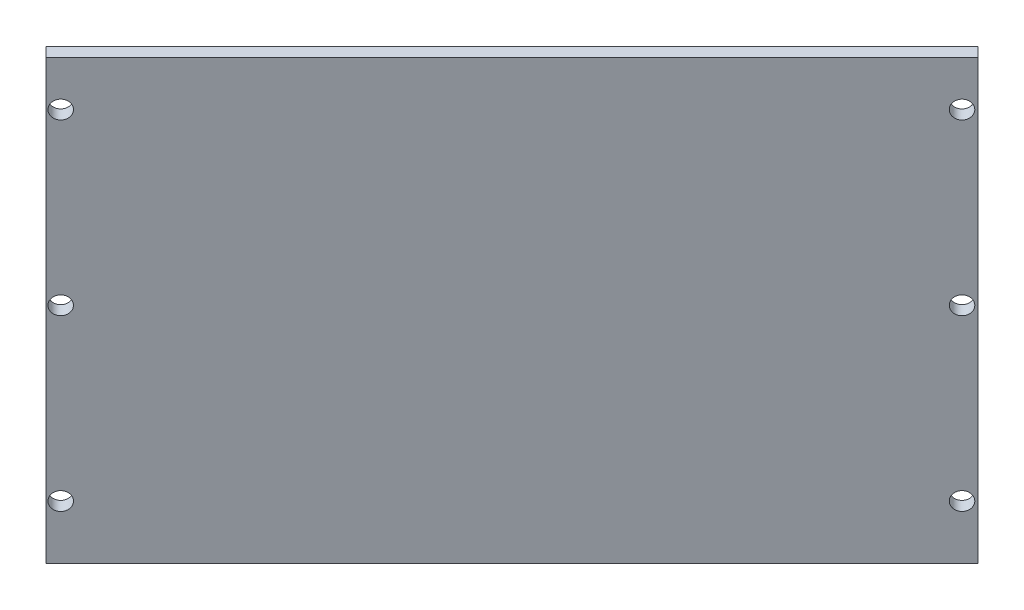
ISO-10303-21;
HEADER;
FILE_DESCRIPTION(('STEP AP214'),'2;1');
FILE_NAME('part.step','',(''),(''),'','','');
FILE_SCHEMA(('AUTOMOTIVE_DESIGN { 1 0 10303 214 1 1 1 1 }'));
ENDSEC;
DATA;
#1=APPLICATION_CONTEXT('core data for automotive mechanical design processes');
#2=APPLICATION_PROTOCOL_DEFINITION('international standard','automotive_design',2000,#1);
#3=PRODUCT_CONTEXT('',#1,'mechanical');
#4=PRODUCT('Part','Part','',(#3));
#5=PRODUCT_RELATED_PRODUCT_CATEGORY('part','',(#4));
#6=PRODUCT_DEFINITION_FORMATION('','',#4);
#7=PRODUCT_DEFINITION_CONTEXT('part definition',#1,'design');
#8=PRODUCT_DEFINITION('design','',#6,#7);
#9=PRODUCT_DEFINITION_SHAPE('','',#8);
#10=(LENGTH_UNIT() NAMED_UNIT(*) SI_UNIT(.MILLI.,.METRE.));
#11=(NAMED_UNIT(*) PLANE_ANGLE_UNIT() SI_UNIT($,.RADIAN.));
#12=(NAMED_UNIT(*) SI_UNIT($,.STERADIAN.) SOLID_ANGLE_UNIT());
#13=UNCERTAINTY_MEASURE_WITH_UNIT(LENGTH_MEASURE(1.E-05),#10,'distance_accuracy_value','');
#14=(GEOMETRIC_REPRESENTATION_CONTEXT(3) GLOBAL_UNCERTAINTY_ASSIGNED_CONTEXT((#13)) GLOBAL_UNIT_ASSIGNED_CONTEXT((#10,
#11,#12)) REPRESENTATION_CONTEXT('',''));
#15=CARTESIAN_POINT('',(0.,0.,0.));
#16=DIRECTION('',(0.,0.,1.));
#17=DIRECTION('',(1.,0.,0.));
#18=AXIS2_PLACEMENT_3D('',#15,#16,#17);
#19=CARTESIAN_POINT('',(202.656854249492,100.,-147.656854249492));
#20=DIRECTION('',(-0.707106781186548,0.,-0.707106781186547));
#21=DIRECTION('',(-0.707106781186547,0.,0.707106781186548));
#22=AXIS2_PLACEMENT_3D('',#19,#20,#21);
#23=PLANE('',#22);
#24=CARTESIAN_POINT('',(80.070276225373,90.,-25.070276225373));
#25=DIRECTION('',(0.707106781186548,0.,0.707106781186547));
#26=DIRECTION('',(0.707106781186547,0.,-0.707106781186548));
#27=AXIS2_PLACEMENT_3D('',#24,#25,#26);
#28=CIRCLE('',#27,1.99999999999999);
#29=CARTESIAN_POINT('',(81.4844897877461,90.,-26.4844897877461));
#30=VERTEX_POINT('',#29);
#31=EDGE_CURVE('E140',#30,#30,#28,.T.);
#32=ORIENTED_EDGE('',*,*,#31,.F.);
#33=EDGE_LOOP('',(#32));
#34=FACE_BOUND('',#33,.T.);
#35=CARTESIAN_POINT('',(80.070276225373,52.5,-25.070276225373));
#36=DIRECTION('',(0.707106781186548,0.,0.707106781186547));
#37=DIRECTION('',(0.707106781186547,0.,-0.707106781186548));
#38=AXIS2_PLACEMENT_3D('',#35,#36,#37);
#39=CIRCLE('',#38,1.99999999999999);
#40=CARTESIAN_POINT('',(81.4844897877461,52.5,-26.4844897877461));
#41=VERTEX_POINT('',#40);
#42=EDGE_CURVE('E134',#41,#41,#39,.T.);
#43=ORIENTED_EDGE('',*,*,#42,.F.);
#44=EDGE_LOOP('',(#43));
#45=FACE_BOUND('',#44,.T.);
#46=CARTESIAN_POINT('',(80.070276225373,15.,-25.070276225373));
#47=DIRECTION('',(0.707106781186548,0.,0.707106781186547));
#48=DIRECTION('',(0.707106781186547,0.,-0.707106781186548));
#49=AXIS2_PLACEMENT_3D('',#46,#47,#48);
#50=CIRCLE('',#49,1.99999999999999);
#51=CARTESIAN_POINT('',(81.4844897877461,15.,-26.4844897877461));
#52=VERTEX_POINT('',#51);
#53=EDGE_CURVE('E128',#52,#52,#50,.T.);
#54=ORIENTED_EDGE('',*,*,#53,.F.);
#55=EDGE_LOOP('',(#54));
#56=FACE_BOUND('',#55,.T.);
#57=CARTESIAN_POINT('',(179.766965190583,15.,-124.766965190583));
#58=DIRECTION('',(0.707106781186548,0.,0.707106781186547));
#59=DIRECTION('',(0.707106781186547,0.,-0.707106781186548));
#60=AXIS2_PLACEMENT_3D('',#57,#58,#59);
#61=CIRCLE('',#60,1.99999999999999);
#62=CARTESIAN_POINT('',(181.181178752956,15.,-126.181178752956));
#63=VERTEX_POINT('',#62);
#64=EDGE_CURVE('E125',#63,#63,#61,.T.);
#65=ORIENTED_EDGE('',*,*,#64,.F.);
#66=EDGE_LOOP('',(#65));
#67=FACE_BOUND('',#66,.T.);
#68=CARTESIAN_POINT('',(179.766965190583,52.5,-124.766965190583));
#69=DIRECTION('',(0.707106781186548,0.,0.707106781186547));
#70=DIRECTION('',(0.707106781186547,0.,-0.707106781186548));
#71=AXIS2_PLACEMENT_3D('',#68,#69,#70);
#72=CIRCLE('',#71,1.99999999999999);
#73=CARTESIAN_POINT('',(181.181178752956,52.5,-126.181178752956));
#74=VERTEX_POINT('',#73);
#75=EDGE_CURVE('E119',#74,#74,#72,.T.);
#76=ORIENTED_EDGE('',*,*,#75,.F.);
#77=EDGE_LOOP('',(#76));
#78=FACE_BOUND('',#77,.T.);
#79=DIRECTION('',(0.707106781186547,0.,-0.707106781186548));
#80=VECTOR('',#79,1.);
#81=CARTESIAN_POINT('',(202.656854249492,100.,-147.656854249492));
#82=LINE('',#81,#80);
#83=CARTESIAN_POINT('',(78.4439306286439,100.,-23.443930628644));
#84=VERTEX_POINT('',#83);
#85=CARTESIAN_POINT('',(181.534732143549,100.,-126.534732143549));
#86=VERTEX_POINT('',#85);
#87=EDGE_CURVE('E46',#84,#86,#82,.T.);
#88=ORIENTED_EDGE('',*,*,#87,.F.);
#89=DIRECTION('',(0.,-1.,0.));
#90=VECTOR('',#89,1.);
#91=CARTESIAN_POINT('',(78.4439306286439,100.,-23.443930628644));
#92=LINE('',#91,#90);
#93=CARTESIAN_POINT('',(78.4439306286439,2.99999999999999,-23.443930628644));
#94=VERTEX_POINT('',#93);
#95=EDGE_CURVE('E110',#84,#94,#92,.T.);
#96=ORIENTED_EDGE('',*,*,#95,.T.);
#97=DIRECTION('',(0.707106781186547,0.,-0.707106781186548));
#98=VECTOR('',#97,1.);
#99=CARTESIAN_POINT('',(202.656854249492,2.99999999999998,-147.656854249492));
#100=LINE('',#99,#98);
#101=CARTESIAN_POINT('',(181.534732143549,2.99999999999998,-126.534732143549));
#102=VERTEX_POINT('',#101);
#103=EDGE_CURVE('E106',#94,#102,#100,.T.);
#104=ORIENTED_EDGE('',*,*,#103,.T.);
#105=DIRECTION('',(0.,1.,0.));
#106=VECTOR('',#105,1.);
#107=CARTESIAN_POINT('',(181.534732143549,100.,-126.534732143549));
#108=LINE('',#107,#106);
#109=EDGE_CURVE('E62',#102,#86,#108,.T.);
#110=ORIENTED_EDGE('',*,*,#109,.T.);
#111=EDGE_LOOP('',(#88,#96,#104,#110));
#112=FACE_BOUND('',#111,.T.);
#113=CARTESIAN_POINT('',(179.766965190583,90.,-124.766965190583));
#114=DIRECTION('',(0.707106781186548,0.,0.707106781186547));
#115=DIRECTION('',(0.707106781186547,0.,-0.707106781186548));
#116=AXIS2_PLACEMENT_3D('',#113,#114,#115);
#117=CIRCLE('',#116,1.99999999999999);
#118=CARTESIAN_POINT('',(181.181178752956,90.,-126.181178752956));
#119=VERTEX_POINT('',#118);
#120=EDGE_CURVE('E100',#119,#119,#117,.T.);
#121=ORIENTED_EDGE('',*,*,#120,.F.);
#122=EDGE_LOOP('',(#121));
#123=FACE_BOUND('',#122,.T.);
#124=ADVANCED_FACE('F37',(#34,#45,#56,#67,#78,#112,#123),#23,.F.);
#125=CARTESIAN_POINT('',(81.1885813427707,2.98999999999998,-20.6992799145172));
#126=DIRECTION('',(0.707106781186547,0.,-0.707106781186548));
#127=DIRECTION('',(-0.707106781186548,0.,-0.707106781186547));
#128=AXIS2_PLACEMENT_3D('',#125,#126,#127);
#129=PLANE('',#128);
#130=ORIENTED_EDGE('',*,*,#95,.F.);
#131=DIRECTION('',(0.707106781186548,0.,0.707106781186547));
#132=VECTOR('',#131,1.);
#133=CARTESIAN_POINT('',(-41.056069371356,100.,-142.943930628644));
#134=LINE('',#133,#132);
#135=CARTESIAN_POINT('',(76.3226102850843,100.,-25.5652509722036));
#136=VERTEX_POINT('',#135);
#137=EDGE_CURVE('E54',#136,#84,#134,.T.);
#138=ORIENTED_EDGE('',*,*,#137,.F.);
#139=DIRECTION('',(0.,1.,0.));
#140=VECTOR('',#139,1.);
#141=CARTESIAN_POINT('',(76.3226102850843,2.98999999999998,-25.5652509722036));
#142=LINE('',#141,#140);
#143=CARTESIAN_POINT('',(76.3226102850843,2.99999999999999,-25.5652509722036));
#144=VERTEX_POINT('',#143);
#145=EDGE_CURVE('E87',#144,#136,#142,.T.);
#146=ORIENTED_EDGE('',*,*,#145,.F.);
#147=DIRECTION('',(-0.707106781186548,0.,-0.707106781186547));
#148=VECTOR('',#147,1.);
#149=CARTESIAN_POINT('',(50.9489306286439,2.99999999999999,-50.938930628644));
#150=LINE('',#149,#148);
#151=EDGE_CURVE('E97',#94,#144,#150,.T.);
#152=ORIENTED_EDGE('',*,*,#151,.F.);
#153=EDGE_LOOP('',(#130,#138,#146,#152));
#154=FACE_BOUND('',#153,.T.);
#155=ADVANCED_FACE('F149',(#154),#129,.F.);
#156=CARTESIAN_POINT('',(179.413411799989,2.98999999999998,-128.656052487109));
#157=DIRECTION('',(-0.707106781186547,0.,0.707106781186547));
#158=DIRECTION('',(0.707106781186548,0.,0.707106781186548));
#159=AXIS2_PLACEMENT_3D('',#156,#157,#158);
#160=PLANE('',#159);
#161=DIRECTION('',(0.,1.,0.));
#162=VECTOR('',#161,1.);
#163=CARTESIAN_POINT('',(179.413411799989,2.98999999999998,-128.656052487109));
#164=LINE('',#163,#162);
#165=CARTESIAN_POINT('',(179.413411799989,2.99999999999998,-128.656052487109));
#166=VERTEX_POINT('',#165);
#167=CARTESIAN_POINT('',(179.413411799989,100.,-128.656052487109));
#168=VERTEX_POINT('',#167);
#169=EDGE_CURVE('E85',#166,#168,#164,.T.);
#170=ORIENTED_EDGE('',*,*,#169,.T.);
#171=DIRECTION('',(-0.707106781186548,0.,-0.707106781186548));
#172=VECTOR('',#171,1.);
#173=CARTESIAN_POINT('',(62.0347321435492,100.,-246.034732143549));
#174=LINE('',#173,#172);
#175=EDGE_CURVE('E88',#86,#168,#174,.T.);
#176=ORIENTED_EDGE('',*,*,#175,.F.);
#177=ORIENTED_EDGE('',*,*,#109,.F.);
#178=DIRECTION('',(0.707106781186548,0.,0.707106781186548));
#179=VECTOR('',#178,1.);
#180=CARTESIAN_POINT('',(154.039732143549,2.99999999999998,-154.029732143549));
#181=LINE('',#180,#179);
#182=EDGE_CURVE('E94',#166,#102,#181,.T.);
#183=ORIENTED_EDGE('',*,*,#182,.F.);
#184=EDGE_LOOP('',(#170,#176,#177,#183));
#185=FACE_BOUND('',#184,.T.);
#186=ADVANCED_FACE('F93',(#185),#160,.F.);
#187=CARTESIAN_POINT('',(175.877877894057,2.98999999999998,-125.120518581176));
#188=DIRECTION('',(0.707106781186548,0.,0.707106781186548));
#189=DIRECTION('',(0.707106781186548,0.,-0.707106781186548));
#190=AXIS2_PLACEMENT_3D('',#187,#188,#189);
#191=PLANE('',#190);
#192=CARTESIAN_POINT('',(77.9489558818133,90.,-27.1915965689327));
#193=DIRECTION('',(0.707106781186548,0.,0.707106781186548));
#194=DIRECTION('',(0.707106781186548,0.,-0.707106781186548));
#195=AXIS2_PLACEMENT_3D('',#192,#193,#194);
#196=CIRCLE('',#195,1.99999999999999);
#197=CARTESIAN_POINT('',(79.3631694441864,90.,-28.6058101313058));
#198=VERTEX_POINT('',#197);
#199=EDGE_CURVE('E137',#198,#198,#196,.T.);
#200=ORIENTED_EDGE('',*,*,#199,.T.);
#201=EDGE_LOOP('',(#200));
#202=FACE_BOUND('',#201,.T.);
#203=CARTESIAN_POINT('',(77.9489558818133,52.5,-27.1915965689327));
#204=DIRECTION('',(0.707106781186548,0.,0.707106781186548));
#205=DIRECTION('',(0.707106781186548,0.,-0.707106781186548));
#206=AXIS2_PLACEMENT_3D('',#203,#204,#205);
#207=CIRCLE('',#206,1.99999999999999);
#208=CARTESIAN_POINT('',(79.3631694441864,52.5,-28.6058101313058));
#209=VERTEX_POINT('',#208);
#210=EDGE_CURVE('E131',#209,#209,#207,.T.);
#211=ORIENTED_EDGE('',*,*,#210,.T.);
#212=EDGE_LOOP('',(#211));
#213=FACE_BOUND('',#212,.T.);
#214=CARTESIAN_POINT('',(77.9489558818133,15.,-27.1915965689327));
#215=DIRECTION('',(0.707106781186548,0.,0.707106781186548));
#216=DIRECTION('',(0.707106781186548,0.,-0.707106781186548));
#217=AXIS2_PLACEMENT_3D('',#214,#215,#216);
#218=CIRCLE('',#217,1.99999999999999);
#219=CARTESIAN_POINT('',(79.3631694441864,15.,-28.6058101313058));
#220=VERTEX_POINT('',#219);
#221=EDGE_CURVE('E41',#220,#220,#218,.T.);
#222=ORIENTED_EDGE('',*,*,#221,.T.);
#223=EDGE_LOOP('',(#222));
#224=FACE_BOUND('',#223,.T.);
#225=CARTESIAN_POINT('',(177.645644847023,15.,-126.888285534142));
#226=DIRECTION('',(0.707106781186548,0.,0.707106781186548));
#227=DIRECTION('',(0.707106781186548,0.,-0.707106781186548));
#228=AXIS2_PLACEMENT_3D('',#225,#226,#227);
#229=CIRCLE('',#228,1.99999999999999);
#230=CARTESIAN_POINT('',(179.059858409396,15.,-128.302499096516));
#231=VERTEX_POINT('',#230);
#232=EDGE_CURVE('E122',#231,#231,#229,.T.);
#233=ORIENTED_EDGE('',*,*,#232,.T.);
#234=EDGE_LOOP('',(#233));
#235=FACE_BOUND('',#234,.T.);
#236=CARTESIAN_POINT('',(177.645644847023,52.5,-126.888285534142));
#237=DIRECTION('',(0.707106781186548,0.,0.707106781186548));
#238=DIRECTION('',(0.707106781186548,0.,-0.707106781186548));
#239=AXIS2_PLACEMENT_3D('',#236,#237,#238);
#240=CIRCLE('',#239,1.99999999999999);
#241=CARTESIAN_POINT('',(179.059858409396,52.5,-128.302499096516));
#242=VERTEX_POINT('',#241);
#243=EDGE_CURVE('E116',#242,#242,#240,.T.);
#244=ORIENTED_EDGE('',*,*,#243,.T.);
#245=EDGE_LOOP('',(#244));
#246=FACE_BOUND('',#245,.T.);
#247=CARTESIAN_POINT('',(177.645644847023,90.,-126.888285534142));
#248=DIRECTION('',(0.707106781186548,0.,0.707106781186548));
#249=DIRECTION('',(0.707106781186548,0.,-0.707106781186548));
#250=AXIS2_PLACEMENT_3D('',#247,#248,#249);
#251=CIRCLE('',#250,1.99999999999999);
#252=CARTESIAN_POINT('',(179.059858409396,90.,-128.302499096516));
#253=VERTEX_POINT('',#252);
#254=EDGE_CURVE('E95',#253,#253,#251,.T.);
#255=ORIENTED_EDGE('',*,*,#254,.T.);
#256=EDGE_LOOP('',(#255));
#257=FACE_BOUND('',#256,.T.);
#258=ORIENTED_EDGE('',*,*,#169,.F.);
#259=DIRECTION('',(0.707106781186547,0.,-0.707106781186548));
#260=VECTOR('',#259,1.);
#261=CARTESIAN_POINT('',(79.7167228347797,3.,-28.959363521899));
#262=LINE('',#261,#260);
#263=EDGE_CURVE('E90',#144,#166,#262,.T.);
#264=ORIENTED_EDGE('',*,*,#263,.F.);
#265=ORIENTED_EDGE('',*,*,#145,.T.);
#266=DIRECTION('',(0.707106781186547,0.,-0.707106781186548));
#267=VECTOR('',#266,1.);
#268=CARTESIAN_POINT('',(79.7167228347797,100.,-28.959363521899));
#269=LINE('',#268,#267);
#270=EDGE_CURVE('E11',#136,#168,#269,.T.);
#271=ORIENTED_EDGE('',*,*,#270,.T.);
#272=EDGE_LOOP('',(#258,#264,#265,#271));
#273=FACE_BOUND('',#272,.T.);
#274=ADVANCED_FACE('F83',(#202,#213,#224,#235,#246,#257,#273),#191,.F.);
#275=CARTESIAN_POINT('',(0.,3.,0.01000000000001));
#276=DIRECTION('',(0.,1.,0.));
#277=DIRECTION('',(-1.,0.,0.));
#278=AXIS2_PLACEMENT_3D('',#275,#276,#277);
#279=PLANE('',#278);
#280=ORIENTED_EDGE('',*,*,#103,.F.);
#281=ORIENTED_EDGE('',*,*,#151,.T.);
#282=ORIENTED_EDGE('',*,*,#263,.T.);
#283=ORIENTED_EDGE('',*,*,#182,.T.);
#284=EDGE_LOOP('',(#280,#281,#282,#283));
#285=FACE_BOUND('',#284,.T.);
#286=ADVANCED_FACE('F166',(#285),#279,.F.);
#287=CARTESIAN_POINT('',(8.,100.,-192.));
#288=DIRECTION('',(0.,-1.,0.));
#289=DIRECTION('',(0.,0.,-1.));
#290=AXIS2_PLACEMENT_3D('',#287,#288,#289);
#291=PLANE('',#290);
#292=ORIENTED_EDGE('',*,*,#270,.F.);
#293=ORIENTED_EDGE('',*,*,#137,.T.);
#294=ORIENTED_EDGE('',*,*,#87,.T.);
#295=ORIENTED_EDGE('',*,*,#175,.T.);
#296=EDGE_LOOP('',(#292,#293,#294,#295));
#297=FACE_BOUND('',#296,.T.);
#298=ADVANCED_FACE('F39',(#297),#291,.F.);
#299=CARTESIAN_POINT('',(179.766965190583,90.,-124.766965190583));
#300=DIRECTION('',(0.707106781186548,0.,0.707106781186547));
#301=DIRECTION('',(0.707106781186547,0.,-0.707106781186548));
#302=AXIS2_PLACEMENT_3D('',#299,#300,#301);
#303=CYLINDRICAL_SURFACE('',#302,1.99999999999999);
#304=ORIENTED_EDGE('',*,*,#120,.T.);
#305=EDGE_LOOP('',(#304));
#306=FACE_BOUND('',#305,.T.);
#307=ORIENTED_EDGE('',*,*,#254,.F.);
#308=EDGE_LOOP('',(#307));
#309=FACE_BOUND('',#308,.T.);
#310=ADVANCED_FACE('F161',(#306,#309),#303,.F.);
#311=CARTESIAN_POINT('',(179.766965190583,52.5,-124.766965190583));
#312=DIRECTION('',(0.707106781186548,0.,0.707106781186547));
#313=DIRECTION('',(0.707106781186547,0.,-0.707106781186548));
#314=AXIS2_PLACEMENT_3D('',#311,#312,#313);
#315=CYLINDRICAL_SURFACE('',#314,1.99999999999999);
#316=ORIENTED_EDGE('',*,*,#75,.T.);
#317=EDGE_LOOP('',(#316));
#318=FACE_BOUND('',#317,.T.);
#319=ORIENTED_EDGE('',*,*,#243,.F.);
#320=EDGE_LOOP('',(#319));
#321=FACE_BOUND('',#320,.T.);
#322=ADVANCED_FACE('F164',(#318,#321),#315,.F.);
#323=CARTESIAN_POINT('',(179.766965190583,15.,-124.766965190583));
#324=DIRECTION('',(0.707106781186548,0.,0.707106781186547));
#325=DIRECTION('',(0.707106781186547,0.,-0.707106781186548));
#326=AXIS2_PLACEMENT_3D('',#323,#324,#325);
#327=CYLINDRICAL_SURFACE('',#326,1.99999999999999);
#328=ORIENTED_EDGE('',*,*,#64,.T.);
#329=EDGE_LOOP('',(#328));
#330=FACE_BOUND('',#329,.T.);
#331=ORIENTED_EDGE('',*,*,#232,.F.);
#332=EDGE_LOOP('',(#331));
#333=FACE_BOUND('',#332,.T.);
#334=ADVANCED_FACE('F195',(#330,#333),#327,.F.);
#335=CARTESIAN_POINT('',(80.070276225373,15.,-25.070276225373));
#336=DIRECTION('',(0.707106781186548,0.,0.707106781186547));
#337=DIRECTION('',(0.707106781186547,0.,-0.707106781186548));
#338=AXIS2_PLACEMENT_3D('',#335,#336,#337);
#339=CYLINDRICAL_SURFACE('',#338,1.99999999999999);
#340=ORIENTED_EDGE('',*,*,#53,.T.);
#341=EDGE_LOOP('',(#340));
#342=FACE_BOUND('',#341,.T.);
#343=ORIENTED_EDGE('',*,*,#221,.F.);
#344=EDGE_LOOP('',(#343));
#345=FACE_BOUND('',#344,.T.);
#346=ADVANCED_FACE('F203',(#342,#345),#339,.F.);
#347=CARTESIAN_POINT('',(80.070276225373,52.5,-25.070276225373));
#348=DIRECTION('',(0.707106781186548,0.,0.707106781186547));
#349=DIRECTION('',(0.707106781186547,0.,-0.707106781186548));
#350=AXIS2_PLACEMENT_3D('',#347,#348,#349);
#351=CYLINDRICAL_SURFACE('',#350,1.99999999999999);
#352=ORIENTED_EDGE('',*,*,#42,.T.);
#353=EDGE_LOOP('',(#352));
#354=FACE_BOUND('',#353,.T.);
#355=ORIENTED_EDGE('',*,*,#210,.F.);
#356=EDGE_LOOP('',(#355));
#357=FACE_BOUND('',#356,.T.);
#358=ADVANCED_FACE('F211',(#354,#357),#351,.F.);
#359=CARTESIAN_POINT('',(80.070276225373,90.,-25.070276225373));
#360=DIRECTION('',(0.707106781186548,0.,0.707106781186547));
#361=DIRECTION('',(0.707106781186547,0.,-0.707106781186548));
#362=AXIS2_PLACEMENT_3D('',#359,#360,#361);
#363=CYLINDRICAL_SURFACE('',#362,1.99999999999999);
#364=ORIENTED_EDGE('',*,*,#31,.T.);
#365=EDGE_LOOP('',(#364));
#366=FACE_BOUND('',#365,.T.);
#367=ORIENTED_EDGE('',*,*,#199,.F.);
#368=EDGE_LOOP('',(#367));
#369=FACE_BOUND('',#368,.T.);
#370=ADVANCED_FACE('F144',(#366,#369),#363,.F.);
#371=CLOSED_SHELL('',(#124,#155,#186,#274,#286,#298,#310,#322,#334,#346,#358,#370));
#372=MANIFOLD_SOLID_BREP('B2',#371);
#373=ADVANCED_BREP_SHAPE_REPRESENTATION('',(#18,#372),#14);
#374=SHAPE_DEFINITION_REPRESENTATION(#9,#373);
ENDSEC;
END-ISO-10303-21;
